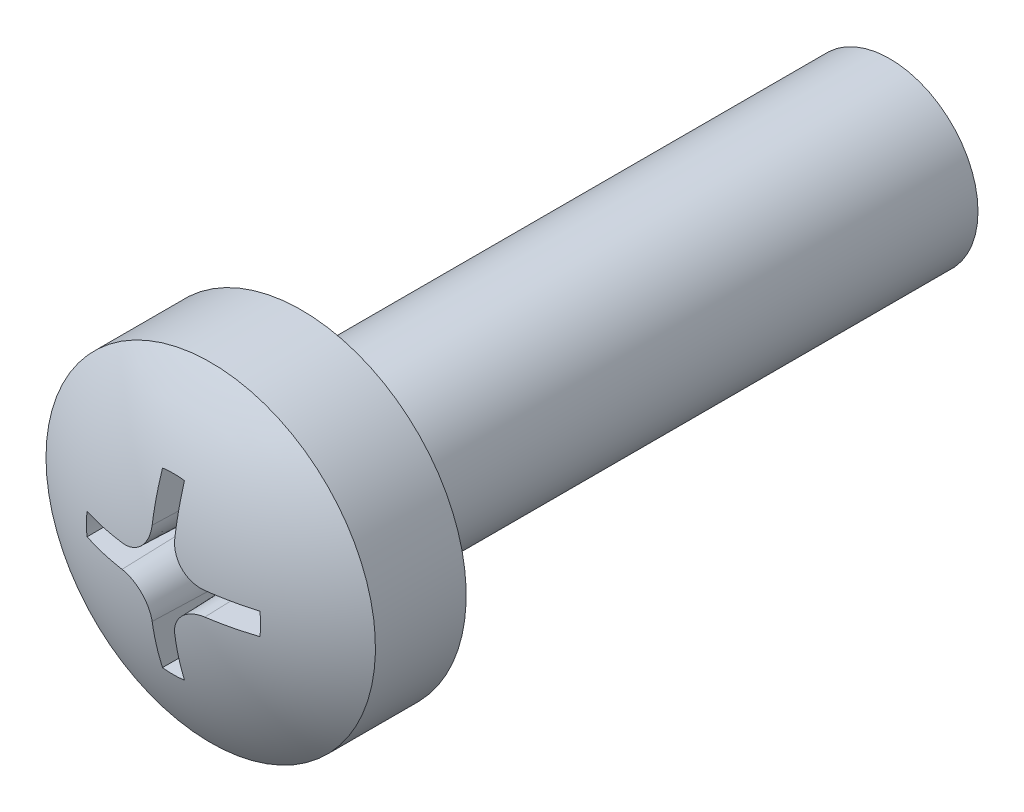
ISO-10303-21;
HEADER;
FILE_DESCRIPTION(('STEP AP214'),'2;1');
FILE_NAME('part.step','',(''),(''),'','','');
FILE_SCHEMA(('AUTOMOTIVE_DESIGN { 1 0 10303 214 1 1 1 1 }'));
ENDSEC;
DATA;
#1=APPLICATION_CONTEXT('core data for automotive mechanical design processes');
#2=APPLICATION_PROTOCOL_DEFINITION('international standard','automotive_design',2000,#1);
#3=PRODUCT_CONTEXT('',#1,'mechanical');
#4=PRODUCT('Part','Part','',(#3));
#5=PRODUCT_RELATED_PRODUCT_CATEGORY('part','',(#4));
#6=PRODUCT_DEFINITION_FORMATION('','',#4);
#7=PRODUCT_DEFINITION_CONTEXT('part definition',#1,'design');
#8=PRODUCT_DEFINITION('design','',#6,#7);
#9=PRODUCT_DEFINITION_SHAPE('','',#8);
#10=(LENGTH_UNIT() NAMED_UNIT(*) SI_UNIT(.MILLI.,.METRE.));
#11=(NAMED_UNIT(*) PLANE_ANGLE_UNIT() SI_UNIT($,.RADIAN.));
#12=(NAMED_UNIT(*) SI_UNIT($,.STERADIAN.) SOLID_ANGLE_UNIT());
#13=UNCERTAINTY_MEASURE_WITH_UNIT(LENGTH_MEASURE(1.E-05),#10,'distance_accuracy_value','');
#14=(GEOMETRIC_REPRESENTATION_CONTEXT(3) GLOBAL_UNCERTAINTY_ASSIGNED_CONTEXT((#13)) GLOBAL_UNIT_ASSIGNED_CONTEXT((#10,
#11,#12)) REPRESENTATION_CONTEXT('',''));
#15=CARTESIAN_POINT('',(0.,0.,0.));
#16=DIRECTION('',(0.,0.,1.));
#17=DIRECTION('',(1.,0.,0.));
#18=AXIS2_PLACEMENT_3D('',#15,#16,#17);
#19=CARTESIAN_POINT('',(0.,0.,10.));
#20=DIRECTION('',(0.,0.,-1.));
#21=DIRECTION('',(-1.,0.,0.));
#22=AXIS2_PLACEMENT_3D('',#19,#20,#21);
#23=CYLINDRICAL_SURFACE('',#22,1.5);
#24=CARTESIAN_POINT('',(0.,0.,10.));
#25=DIRECTION('',(0.,0.,1.));
#26=DIRECTION('',(1.,0.,0.));
#27=AXIS2_PLACEMENT_3D('',#24,#25,#26);
#28=CIRCLE('',#27,1.5);
#29=CARTESIAN_POINT('',(1.5,0.,10.));
#30=VERTEX_POINT('',#29);
#31=EDGE_CURVE('E208',#30,#30,#28,.T.);
#32=ORIENTED_EDGE('',*,*,#31,.F.);
#33=EDGE_LOOP('',(#32));
#34=FACE_BOUND('',#33,.T.);
#35=CARTESIAN_POINT('',(0.,0.,0.));
#36=DIRECTION('',(0.,0.,1.));
#37=DIRECTION('',(1.,0.,0.));
#38=AXIS2_PLACEMENT_3D('',#35,#36,#37);
#39=CIRCLE('',#38,1.5);
#40=CARTESIAN_POINT('',(1.5,0.,0.));
#41=VERTEX_POINT('',#40);
#42=EDGE_CURVE('E205',#41,#41,#39,.T.);
#43=ORIENTED_EDGE('',*,*,#42,.T.);
#44=EDGE_LOOP('',(#43));
#45=FACE_BOUND('',#44,.T.);
#46=ADVANCED_FACE('F34',(#34,#45),#23,.T.);
#47=CARTESIAN_POINT('',(0.,0.,0.));
#48=DIRECTION('',(0.,0.,1.));
#49=DIRECTION('',(1.,0.,0.));
#50=AXIS2_PLACEMENT_3D('',#47,#48,#49);
#51=PLANE('',#50);
#52=ORIENTED_EDGE('',*,*,#42,.F.);
#53=EDGE_LOOP('',(#52));
#54=FACE_BOUND('',#53,.T.);
#55=ADVANCED_FACE('F295',(#54),#51,.F.);
#56=CARTESIAN_POINT('',(0.,0.,10.));
#57=DIRECTION('',(0.,0.,-1.));
#58=DIRECTION('',(-1.,0.,0.));
#59=AXIS2_PLACEMENT_3D('',#56,#57,#58);
#60=PLANE('',#59);
#61=CARTESIAN_POINT('',(0.,0.,10.));
#62=DIRECTION('',(0.,0.,-1.));
#63=DIRECTION('',(-1.,0.,0.));
#64=AXIS2_PLACEMENT_3D('',#61,#62,#63);
#65=CIRCLE('',#64,2.79999990016222);
#66=CARTESIAN_POINT('',(-2.79999990016222,0.,10.));
#67=VERTEX_POINT('',#66);
#68=EDGE_CURVE('E202',#67,#67,#65,.T.);
#69=ORIENTED_EDGE('',*,*,#68,.T.);
#70=EDGE_LOOP('',(#69));
#71=FACE_BOUND('',#70,.T.);
#72=ORIENTED_EDGE('',*,*,#31,.T.);
#73=EDGE_LOOP('',(#72));
#74=FACE_BOUND('',#73,.T.);
#75=ADVANCED_FACE('F300',(#71,#74),#60,.T.);
#76=CARTESIAN_POINT('',(0.,0.,-0.393620134621003));
#77=DIRECTION('',(0.,0.,-1.));
#78=DIRECTION('',(-1.,0.,0.));
#79=AXIS2_PLACEMENT_3D('',#76,#77,#78);
#80=CYLINDRICAL_SURFACE('',#79,2.79999990016222);
#81=CARTESIAN_POINT('',(0.,0.,11.5424630797893));
#82=DIRECTION('',(0.,0.,-1.));
#83=DIRECTION('',(-1.,0.,0.));
#84=AXIS2_PLACEMENT_3D('',#81,#82,#83);
#85=CIRCLE('',#84,2.79999990016222);
#86=CARTESIAN_POINT('',(-2.79999990016222,0.,11.5424630797893));
#87=VERTEX_POINT('',#86);
#88=EDGE_CURVE('E150',#87,#87,#85,.T.);
#89=ORIENTED_EDGE('',*,*,#88,.T.);
#90=EDGE_LOOP('',(#89));
#91=FACE_BOUND('',#90,.T.);
#92=ORIENTED_EDGE('',*,*,#68,.F.);
#93=EDGE_LOOP('',(#92));
#94=FACE_BOUND('',#93,.T.);
#95=ADVANCED_FACE('F307',(#91,#94),#80,.T.);
#96=CARTESIAN_POINT('',(0.,0.,7.40000011175871));
#97=DIRECTION('',(0.,0.,-1.));
#98=DIRECTION('',(1.,0.,0.));
#99=AXIS2_PLACEMENT_3D('',#96,#97,#98);
#100=SPHERICAL_SURFACE('',#99,4.99999988824129);
#101=CARTESIAN_POINT('',(0.,0.,12.1754183821502));
#102=DIRECTION('',(0.,0.,-1.));
#103=DIRECTION('',(-1.,0.,0.));
#104=AXIS2_PLACEMENT_3D('',#101,#102,#103);
#105=CIRCLE('',#104,1.4816812157899);
#106=CARTESIAN_POINT('',(0.18668120666759,1.46987392394782,12.1754183821501));
#107=VERTEX_POINT('',#106);
#108=CARTESIAN_POINT('',(-0.186681206667593,1.46987392394782,12.1754183821501));
#109=VERTEX_POINT('',#108);
#110=EDGE_CURVE('E11',#107,#109,#105,.F.);
#111=ORIENTED_EDGE('',*,*,#110,.F.);
#112=CARTESIAN_POINT('',(0.0198956640512633,0.,7.39930533986049));
#113=DIRECTION('',(0.999390827019096,0.,-0.034899496702501));
#114=DIRECTION('',(-0.034899496702501,0.,-0.999390827019096));
#115=AXIS2_PLACEMENT_3D('',#112,#113,#114);
#116=CIRCLE('',#115,4.99996025606773);
#117=CARTESIAN_POINT('',(0.192632610704328,0.708178557647151,12.3458442955351));
#118=VERTEX_POINT('',#117);
#119=EDGE_CURVE('E41',#107,#118,#116,.T.);
#120=ORIENTED_EDGE('',*,*,#119,.T.);
#121=CARTESIAN_POINT('',(0.192631650862954,0.708378557647151,12.345815691475));
#122=CARTESIAN_POINT('',(0.192737639690806,0.679822741796073,12.3499041439734));
#123=CARTESIAN_POINT('',(0.195268867839181,0.651227392830895,12.3536463362414));
#124=CARTESIAN_POINT('',(0.205046889209158,0.594767038274589,12.3603460551712));
#125=CARTESIAN_POINT('',(0.212292618678018,0.566901869404939,12.3633037586285));
#126=CARTESIAN_POINT('',(0.231373694375068,0.51267267841366,12.3683466063254));
#127=CARTESIAN_POINT('',(0.24321326807329,0.486310064716558,12.3704309431667));
#128=CARTESIAN_POINT('',(0.271156607880554,0.435900324544808,12.3736603491012));
#129=CARTESIAN_POINT('',(0.287258672100205,0.411852279143785,12.3748057923215));
#130=CARTESIAN_POINT('',(0.323072075489885,0.367028886470806,12.3761158025717));
#131=CARTESIAN_POINT('',(0.342740648168188,0.346219679514825,12.3762912893596));
#132=CARTESIAN_POINT('',(0.385246757538768,0.30814670944778,12.3756853456951));
#133=CARTESIAN_POINT('',(0.408084792807392,0.290883505206881,12.3749037645383));
#134=CARTESIAN_POINT('',(0.456147210008961,0.260464262414973,12.3724133951705));
#135=CARTESIAN_POINT('',(0.481359759209805,0.247289131136678,12.3707090224733));
#136=CARTESIAN_POINT('',(0.533541444049374,0.225283958921734,12.3664258870809));
#137=CARTESIAN_POINT('',(0.560509920861878,0.216452298826715,12.3638474508254));
#138=CARTESIAN_POINT('',(0.606876295057338,0.205379627868596,12.3588207651558));
#139=CARTESIAN_POINT('',(0.626020977094074,0.201943221890058,12.3565812960749));
#140=CARTESIAN_POINT('',(0.664502044043211,0.197253494550335,12.3517582366185));
#141=CARTESIAN_POINT('',(0.683838077649067,0.195996727127303,12.349175196413));
#142=CARTESIAN_POINT('',(0.703167546290468,0.195835015722444,12.3464334662955));
#143=B_SPLINE_CURVE_WITH_KNOTS('',3,(#121,#122,#123,#124,#125,#126,#127,#128,#129,#130,#131,
#132,#133,#134,#135,#136,#137,#138,#139,#140,#141,#142),.UNSPECIFIED.,.F.,.F.,(4,2,2,2,2,2,2,2,
2,2,4),(0.,0.0864417829586748,0.172864068455127,0.259366073122685,0.345833591994609,
0.431325646912079,0.516831165542017,0.601931114274005,0.686999315371811,0.745618262708562,
0.804144447281415),.UNSPECIFIED.);
#144=CARTESIAN_POINT('',(0.702917362553185,0.19583721033533,12.3464689381926));
#145=VERTEX_POINT('',#144);
#146=EDGE_CURVE('E277',#118,#145,#143,.T.);
#147=ORIENTED_EDGE('',*,*,#146,.T.);
#148=CARTESIAN_POINT('',(0.000105390153350939,0.0259265633149154,7.39909472873738));
#149=DIRECTION('',(0.00406243901494415,0.999382570249833,-0.034899496702501));
#150=DIRECTION('',(0.,0.0348997846864301,0.999390816962434));
#151=AXIS2_PLACEMENT_3D('',#148,#149,#150);
#152=CIRCLE('',#151,4.99993258603575);
#153=CARTESIAN_POINT('',(1.46986565043204,0.186746338396853,12.1754183821502));
#154=VERTEX_POINT('',#153);
#155=EDGE_CURVE('E275',#154,#145,#152,.F.);
#156=ORIENTED_EDGE('',*,*,#155,.F.);
#157=CARTESIAN_POINT('',(0.,0.,12.1754183821502));
#158=DIRECTION('',(0.,0.,-1.));
#159=DIRECTION('',(-1.,0.,0.));
#160=AXIS2_PLACEMENT_3D('',#157,#158,#159);
#161=CIRCLE('',#160,1.4816812157899);
#162=CARTESIAN_POINT('',(1.46986565043204,-0.186746338396852,12.1754183821501));
#163=VERTEX_POINT('',#162);
#164=EDGE_CURVE('E273',#163,#154,#161,.F.);
#165=ORIENTED_EDGE('',*,*,#164,.F.);
#166=CARTESIAN_POINT('',(0.00010539015335097,-0.0259265633149168,7.39909472873738));
#167=DIRECTION('',(0.00406243901494512,-0.999382570249833,-0.034899496702501));
#168=DIRECTION('',(0.,0.0348997846864301,-0.999390816962434));
#169=AXIS2_PLACEMENT_3D('',#166,#167,#168);
#170=CIRCLE('',#169,4.99993258603575);
#171=CARTESIAN_POINT('',(0.702917362553185,-0.195837210335331,12.3464689381926));
#172=VERTEX_POINT('',#171);
#173=EDGE_CURVE('E270',#163,#172,#170,.T.);
#174=ORIENTED_EDGE('',*,*,#173,.T.);
#175=CARTESIAN_POINT('',(0.192631650862954,-0.708378557647152,12.345815691475));
#176=CARTESIAN_POINT('',(0.192737639690806,-0.679822741796074,12.3499041439734));
#177=CARTESIAN_POINT('',(0.195268867839181,-0.651227392830896,12.3536463362414));
#178=CARTESIAN_POINT('',(0.205046889209158,-0.59476703827459,12.3603460551712));
#179=CARTESIAN_POINT('',(0.212292618678018,-0.56690186940494,12.3633037586285));
#180=CARTESIAN_POINT('',(0.231373694375068,-0.512672678413661,12.3683466063254));
#181=CARTESIAN_POINT('',(0.24321326807329,-0.486310064716559,12.3704309431667));
#182=CARTESIAN_POINT('',(0.271156607880554,-0.435900324544809,12.3736603491012));
#183=CARTESIAN_POINT('',(0.287258672100205,-0.411852279143786,12.3748057923215));
#184=CARTESIAN_POINT('',(0.323072075489885,-0.367028886470807,12.3761158025717));
#185=CARTESIAN_POINT('',(0.342740648168188,-0.346219679514826,12.3762912893596));
#186=CARTESIAN_POINT('',(0.385246757538768,-0.30814670944778,12.3756853456951));
#187=CARTESIAN_POINT('',(0.408084792807392,-0.290883505206882,12.3749037645383));
#188=CARTESIAN_POINT('',(0.456147210008961,-0.260464262414974,12.3724133951705));
#189=CARTESIAN_POINT('',(0.481359759209805,-0.247289131136679,12.3707090224733));
#190=CARTESIAN_POINT('',(0.533541444049374,-0.225283958921735,12.3664258870809));
#191=CARTESIAN_POINT('',(0.560509920861877,-0.216452298826716,12.3638474508254));
#192=CARTESIAN_POINT('',(0.606876295057338,-0.205379627868597,12.3588207651558));
#193=CARTESIAN_POINT('',(0.626020977094074,-0.201943221890059,12.3565812960749));
#194=CARTESIAN_POINT('',(0.66450204404321,-0.197253494550336,12.3517582366185));
#195=CARTESIAN_POINT('',(0.683838077649067,-0.195996727127304,12.349175196413));
#196=CARTESIAN_POINT('',(0.703167546290467,-0.195835015722445,12.3464334662955));
#197=B_SPLINE_CURVE_WITH_KNOTS('',3,(#175,#176,#177,#178,#179,#180,#181,#182,#183,#184,#185,
#186,#187,#188,#189,#190,#191,#192,#193,#194,#195,#196),.UNSPECIFIED.,.F.,.F.,(4,2,2,2,2,2,2,2,
2,2,4),(0.,0.0864417829586748,0.172864068455127,0.259366073122684,0.345833591994609,
0.431325646912079,0.516831165542017,0.601931114274005,0.686999315371811,0.745618262708562,
0.804144447281415),.UNSPECIFIED.);
#198=CARTESIAN_POINT('',(0.192632610704328,-0.708178557647152,12.3458442955351));
#199=VERTEX_POINT('',#198);
#200=EDGE_CURVE('E264',#199,#172,#197,.T.);
#201=ORIENTED_EDGE('',*,*,#200,.F.);
#202=CARTESIAN_POINT('',(0.0198956640512633,0.,7.39930533986049));
#203=DIRECTION('',(0.999390827019096,0.,-0.034899496702501));
#204=DIRECTION('',(-0.034899496702501,0.,-0.999390827019096));
#205=AXIS2_PLACEMENT_3D('',#202,#203,#204);
#206=CIRCLE('',#205,4.99996025606773);
#207=CARTESIAN_POINT('',(0.186681206667591,-1.46987392394782,12.1754183821502));
#208=VERTEX_POINT('',#207);
#209=EDGE_CURVE('E262',#208,#199,#206,.F.);
#210=ORIENTED_EDGE('',*,*,#209,.F.);
#211=CARTESIAN_POINT('',(0.,0.,12.1754183821502));
#212=DIRECTION('',(0.,0.,-1.));
#213=DIRECTION('',(-1.,0.,0.));
#214=AXIS2_PLACEMENT_3D('',#211,#212,#213);
#215=CIRCLE('',#214,1.4816812157899);
#216=CARTESIAN_POINT('',(-0.186681206667593,-1.46987392394782,12.1754183821501));
#217=VERTEX_POINT('',#216);
#218=EDGE_CURVE('E259',#208,#217,#215,.T.);
#219=ORIENTED_EDGE('',*,*,#218,.T.);
#220=CARTESIAN_POINT('',(-0.0198956640512654,0.,7.39930533986049));
#221=DIRECTION('',(-0.999390827019096,0.,-0.034899496702501));
#222=DIRECTION('',(-0.034899496702501,0.,0.999390827019096));
#223=AXIS2_PLACEMENT_3D('',#220,#221,#222);
#224=CIRCLE('',#223,4.99996025606773);
#225=CARTESIAN_POINT('',(-0.19263261070433,-0.708178557647151,12.3458442955351));
#226=VERTEX_POINT('',#225);
#227=EDGE_CURVE('E255',#217,#226,#224,.T.);
#228=ORIENTED_EDGE('',*,*,#227,.T.);
#229=CARTESIAN_POINT('',(-0.70316754629047,-0.195835015722445,12.3464334662955));
#230=CARTESIAN_POINT('',(-0.674619447950853,-0.196052963217916,12.3504857241648));
#231=CARTESIAN_POINT('',(-0.646041434637229,-0.198695168407334,12.3541890416191));
#232=CARTESIAN_POINT('',(-0.589634494727846,-0.208689654905481,12.3608068014756));
#233=CARTESIAN_POINT('',(-0.561805393198952,-0.216040826152062,12.3637214295682));
#234=CARTESIAN_POINT('',(-0.50766612082123,-0.235323893103952,12.3686750861046));
#235=CARTESIAN_POINT('',(-0.481357369172764,-0.247259991703852,12.370713307523));
#236=CARTESIAN_POINT('',(-0.431071022991569,-0.275383990623327,12.3738489099634));
#237=CARTESIAN_POINT('',(-0.407092510169895,-0.291570206692358,12.3749466629444));
#238=CARTESIAN_POINT('',(-0.362416703115867,-0.327538701485094,12.3761618083202));
#239=CARTESIAN_POINT('',(-0.34168588735275,-0.347278991317759,12.376289966384));
#240=CARTESIAN_POINT('',(-0.303780328011577,-0.389912448398922,12.375590364716));
#241=CARTESIAN_POINT('',(-0.286606147147997,-0.412806113607388,12.3747624538554));
#242=CARTESIAN_POINT('',(-0.25636685808405,-0.460969475916929,12.3721816258056));
#243=CARTESIAN_POINT('',(-0.243283863198687,-0.486228184526672,12.3704328274806));
#244=CARTESIAN_POINT('',(-0.22146899790456,-0.538485231439468,12.366063898297));
#245=CARTESIAN_POINT('',(-0.212735526227358,-0.565482925398505,12.3634440886927));
#246=CARTESIAN_POINT('',(-0.201823996880683,-0.61191361527353,12.3583478129874));
#247=CARTESIAN_POINT('',(-0.198453223120025,-0.631098599357625,12.3560784464194));
#248=CARTESIAN_POINT('',(-0.193901764340931,-0.669652448873598,12.3511968730386));
#249=CARTESIAN_POINT('',(-0.192717622166763,-0.689020975292663,12.3485852144187));
#250=CARTESIAN_POINT('',(-0.192631650862956,-0.708378557647151,12.345815691475));
#251=B_SPLINE_CURVE_WITH_KNOTS('',3,(#229,#230,#231,#232,#233,#234,#235,#236,#237,#238,#239,
#240,#241,#242,#243,#244,#245,#246,#247,#248,#249,#250),.UNSPECIFIED.,.F.,.F.,(4,2,2,2,2,2,2,2,
2,2,4),(0.,0.0864053436114194,0.172790326060609,0.259254685287909,0.34568483171133,
0.431153892876567,0.51663646625136,0.601739908197796,0.686811996276178,0.745524819849982,
0.804144736260156),.UNSPECIFIED.);
#252=CARTESIAN_POINT('',(-0.702917362553187,-0.195837210335331,12.3464689381926));
#253=VERTEX_POINT('',#252);
#254=EDGE_CURVE('E248',#253,#226,#251,.T.);
#255=ORIENTED_EDGE('',*,*,#254,.F.);
#256=CARTESIAN_POINT('',(-0.000105390153349066,-0.0259265633149167,7.39909472873738));
#257=DIRECTION('',(-0.0040624390149453,-0.999382570249833,-0.034899496702501));
#258=DIRECTION('',(0.,0.0348997846864301,-0.999390816962434));
#259=AXIS2_PLACEMENT_3D('',#256,#257,#258);
#260=CIRCLE('',#259,4.99993258603575);
#261=CARTESIAN_POINT('',(-1.46986565043204,-0.186746338396853,12.1754183821502));
#262=VERTEX_POINT('',#261);
#263=EDGE_CURVE('E256',#262,#253,#260,.F.);
#264=ORIENTED_EDGE('',*,*,#263,.F.);
#265=CARTESIAN_POINT('',(0.,0.,12.1754183821502));
#266=DIRECTION('',(0.,0.,-1.));
#267=DIRECTION('',(-1.,0.,0.));
#268=AXIS2_PLACEMENT_3D('',#265,#266,#267);
#269=CIRCLE('',#268,1.4816812157899);
#270=CARTESIAN_POINT('',(-1.46986565043204,0.186746338396852,12.1754183821501));
#271=VERTEX_POINT('',#270);
#272=EDGE_CURVE('E594',#262,#271,#269,.T.);
#273=ORIENTED_EDGE('',*,*,#272,.T.);
#274=CARTESIAN_POINT('',(-0.000105390153349066,0.0259265633149167,7.39909472873738));
#275=DIRECTION('',(-0.00406243901494529,0.999382570249833,-0.034899496702501));
#276=DIRECTION('',(0.,0.0348997846864301,0.999390816962434));
#277=AXIS2_PLACEMENT_3D('',#274,#275,#276);
#278=CIRCLE('',#277,4.99993258603575);
#279=CARTESIAN_POINT('',(-0.702917362553187,0.195837210335331,12.3464689381926));
#280=VERTEX_POINT('',#279);
#281=EDGE_CURVE('E221',#271,#280,#278,.T.);
#282=ORIENTED_EDGE('',*,*,#281,.T.);
#283=CARTESIAN_POINT('',(-0.192631650862955,0.708378557647151,12.345815691475));
#284=CARTESIAN_POINT('',(-0.192737639690808,0.679822741796074,12.3499041439734));
#285=CARTESIAN_POINT('',(-0.195268867839183,0.651227392830896,12.3536463362414));
#286=CARTESIAN_POINT('',(-0.20504688920916,0.59476703827459,12.3603460551712));
#287=CARTESIAN_POINT('',(-0.21229261867802,0.566901869404939,12.3633037586285));
#288=CARTESIAN_POINT('',(-0.231373694375069,0.51267267841366,12.3683466063254));
#289=CARTESIAN_POINT('',(-0.243213268073292,0.486310064716559,12.3704309431667));
#290=CARTESIAN_POINT('',(-0.271156607880555,0.435900324544809,12.3736603491012));
#291=CARTESIAN_POINT('',(-0.287258672100206,0.411852279143786,12.3748057923215));
#292=CARTESIAN_POINT('',(-0.323072075489887,0.367028886470806,12.3761158025717));
#293=CARTESIAN_POINT('',(-0.34274064816819,0.346219679514826,12.3762912893596));
#294=CARTESIAN_POINT('',(-0.38524675753877,0.30814670944778,12.3756853456951));
#295=CARTESIAN_POINT('',(-0.408084792807394,0.290883505206882,12.3749037645383));
#296=CARTESIAN_POINT('',(-0.456147210008963,0.260464262414974,12.3724133951705));
#297=CARTESIAN_POINT('',(-0.481359759209807,0.247289131136679,12.3707090224733));
#298=CARTESIAN_POINT('',(-0.533541444049376,0.225283958921735,12.3664258870809));
#299=CARTESIAN_POINT('',(-0.560509920861879,0.216452298826716,12.3638474508254));
#300=CARTESIAN_POINT('',(-0.60687629505734,0.205379627868597,12.3588207651558));
#301=CARTESIAN_POINT('',(-0.626020977094076,0.201943221890059,12.3565812960749));
#302=CARTESIAN_POINT('',(-0.664502044043212,0.197253494550336,12.3517582366185));
#303=CARTESIAN_POINT('',(-0.683838077649068,0.195996727127304,12.349175196413));
#304=CARTESIAN_POINT('',(-0.703167546290469,0.195835015722445,12.3464334662955));
#305=B_SPLINE_CURVE_WITH_KNOTS('',3,(#283,#284,#285,#286,#287,#288,#289,#290,#291,#292,#293,
#294,#295,#296,#297,#298,#299,#300,#301,#302,#303,#304),.UNSPECIFIED.,.F.,.F.,(4,2,2,2,2,2,2,2,
2,2,4),(0.,0.0864417829586745,0.172864068455127,0.259366073122684,0.345833591994609,
0.431325646912079,0.516831165542016,0.601931114274004,0.686999315371811,0.745618262708562,
0.804144447281414),.UNSPECIFIED.);
#306=CARTESIAN_POINT('',(-0.19263261070433,0.708178557647151,12.3458442955351));
#307=VERTEX_POINT('',#306);
#308=EDGE_CURVE('E213',#307,#280,#305,.T.);
#309=ORIENTED_EDGE('',*,*,#308,.F.);
#310=CARTESIAN_POINT('',(-0.0198956640512643,0.,7.39930533986049));
#311=DIRECTION('',(-0.999390827019096,0.,-0.034899496702501));
#312=DIRECTION('',(-0.034899496702501,0.,0.999390827019096));
#313=AXIS2_PLACEMENT_3D('',#310,#311,#312);
#314=CIRCLE('',#313,4.99996025606773);
#315=EDGE_CURVE('E211',#109,#307,#314,.F.);
#316=ORIENTED_EDGE('',*,*,#315,.F.);
#317=EDGE_LOOP('',(#111,#120,#147,#156,#165,#174,#201,#210,#219,#228,#255,#264,#273,#282,#309,#316));
#318=FACE_BOUND('',#317,.T.);
#319=ORIENTED_EDGE('',*,*,#88,.F.);
#320=EDGE_LOOP('',(#319));
#321=FACE_BOUND('',#320,.T.);
#322=ADVANCED_FACE('F223',(#318,#321),#100,.T.);
#323=CARTESIAN_POINT('',(0.,0.,12.7000001));
#324=DIRECTION('',(0.,0.,1.));
#325=DIRECTION('',(1.,0.,0.));
#326=AXIS2_PLACEMENT_3D('',#323,#324,#325);
#327=CONICAL_SURFACE('',#326,1.50000001303852,0.0349065850398867);
#328=ORIENTED_EDGE('',*,*,#110,.T.);
#329=CARTESIAN_POINT('',(-0.142142619910814,1.43009594495933,10.9000001309199));
#330=CARTESIAN_POINT('',(-0.152618658076336,1.43957885994155,11.1999946132293));
#331=CARTESIAN_POINT('',(-0.163094792502732,1.4489727928664,11.4999918520894));
#332=CARTESIAN_POINT('',(-0.184047253837866,1.46758269456637,12.0999918417828));
#333=CARTESIAN_POINT('',(-0.194523580746602,1.47679866334215,12.399994592616));
#334=CARTESIAN_POINT('',(-0.205000003916213,1.48592565006124,12.7000001));
#335=B_SPLINE_CURVE_WITH_KNOTS('',3,(#329,#330,#331,#332,#333,#334),.UNSPECIFIED.,.F.,.F.,(4,2,
4),(0.,0.900981158642231,1.80196231389533),.UNSPECIFIED.);
#336=CARTESIAN_POINT('',(-0.142142619910814,1.43009594495933,10.9000001309199));
#337=VERTEX_POINT('',#336);
#338=EDGE_CURVE('E48',#337,#109,#335,.T.);
#339=ORIENTED_EDGE('',*,*,#338,.F.);
#340=CARTESIAN_POINT('',(0.,0.,10.9000001309199));
#341=DIRECTION('',(0.,0.,1.));
#342=DIRECTION('',(1.,0.,0.));
#343=AXIS2_PLACEMENT_3D('',#340,#341,#342);
#344=CIRCLE('',#343,1.43714262903312);
#345=CARTESIAN_POINT('',(0.142142619910811,1.43009594495933,10.9000001309199));
#346=VERTEX_POINT('',#345);
#347=EDGE_CURVE('E158',#346,#337,#344,.T.);
#348=ORIENTED_EDGE('',*,*,#347,.F.);
#349=CARTESIAN_POINT('',(0.142142619910811,1.43009594495933,10.9000001309199));
#350=CARTESIAN_POINT('',(0.152618658076333,1.43957885994155,11.1999946132293));
#351=CARTESIAN_POINT('',(0.16309479250273,1.4489727928664,11.4999918520894));
#352=CARTESIAN_POINT('',(0.184047253837863,1.46758269456637,12.0999918417828));
#353=CARTESIAN_POINT('',(0.1945235807466,1.47679866334215,12.399994592616));
#354=CARTESIAN_POINT('',(0.205000003916211,1.48592565006124,12.7000001));
#355=B_SPLINE_CURVE_WITH_KNOTS('',3,(#349,#350,#351,#352,#353,#354),.UNSPECIFIED.,.F.,.F.,(4,2,
4),(0.,0.900981158642231,1.80196231389533),.UNSPECIFIED.);
#356=EDGE_CURVE('E142',#346,#107,#355,.T.);
#357=ORIENTED_EDGE('',*,*,#356,.T.);
#358=EDGE_LOOP('',(#328,#339,#348,#357));
#359=FACE_BOUND('',#358,.T.);
#360=ADVANCED_FACE('F162',(#359),#327,.F.);
#361=CARTESIAN_POINT('',(0.205000003916211,1.48592565006124,12.7000001));
#362=DIRECTION('',(0.999390827019096,0.,-0.034899496702501));
#363=DIRECTION('',(-0.034899496702501,0.,-0.999390827019096));
#364=AXIS2_PLACEMENT_3D('',#361,#362,#363);
#365=PLANE('',#364);
#366=ORIENTED_EDGE('',*,*,#356,.F.);
#367=DIRECTION('',(0.,1.,0.));
#368=VECTOR('',#367,1.);
#369=CARTESIAN_POINT('',(0.142142619910812,0.,10.9000001309199));
#370=LINE('',#369,#368);
#371=CARTESIAN_POINT('',(0.142142619910811,0.708178557647151,10.9000001309199));
#372=VERTEX_POINT('',#371);
#373=EDGE_CURVE('E145',#346,#372,#370,.F.);
#374=ORIENTED_EDGE('',*,*,#373,.T.);
#375=DIRECTION('',(0.034899496702501,0.,0.999390827019096));
#376=VECTOR('',#375,1.);
#377=CARTESIAN_POINT('',(0.20500000391621,0.708178557647151,12.7000001));
#378=LINE('',#377,#376);
#379=EDGE_CURVE('E151',#372,#118,#378,.T.);
#380=ORIENTED_EDGE('',*,*,#379,.T.);
#381=ORIENTED_EDGE('',*,*,#119,.F.);
#382=EDGE_LOOP('',(#366,#374,#380,#381));
#383=FACE_BOUND('',#382,.T.);
#384=ADVANCED_FACE('F144',(#383),#365,.F.);
#385=CARTESIAN_POINT('',(0.705000003916211,0.708178557647151,12.7000001));
#386=DIRECTION('',(0.,0.,-1.));
#387=DIRECTION('',(1.,0.,0.));
#388=AXIS2_PLACEMENT_3D('',#385,#386,#387);
#389=CONICAL_SURFACE('',#388,0.5,0.0349065850398867);
#390=ORIENTED_EDGE('',*,*,#379,.F.);
#391=CARTESIAN_POINT('',(0.705000003916211,0.708178557647151,10.9000001309199));
#392=DIRECTION('',(0.,0.,1.));
#393=DIRECTION('',(1.,0.,0.));
#394=AXIS2_PLACEMENT_3D('',#391,#392,#393);
#395=CIRCLE('',#394,0.562857384005399);
#396=CARTESIAN_POINT('',(0.702712036351556,0.145325823858085,10.9000001309199));
#397=VERTEX_POINT('',#396);
#398=EDGE_CURVE('E160',#372,#397,#395,.T.);
#399=ORIENTED_EDGE('',*,*,#398,.T.);
#400=DIRECTION('',(0.000141863496415148,0.0348992083697649,0.999390827019096));
#401=VECTOR('',#400,1.);
#402=CARTESIAN_POINT('',(0.702967546290468,0.208182688548215,12.7000001));
#403=LINE('',#402,#401);
#404=EDGE_CURVE('E420',#397,#145,#403,.T.);
#405=ORIENTED_EDGE('',*,*,#404,.T.);
#406=ORIENTED_EDGE('',*,*,#146,.F.);
#407=EDGE_LOOP('',(#390,#399,#405,#406));
#408=FACE_BOUND('',#407,.T.);
#409=ADVANCED_FACE('F283',(#408),#389,.T.);
#410=CARTESIAN_POINT('',(1.48592565006123,0.205000003916213,12.7000001));
#411=DIRECTION('',(0.00406243901494415,0.999382570249833,-0.034899496702501));
#412=DIRECTION('',(0.,0.0348997846864301,0.999390816962434));
#413=AXIS2_PLACEMENT_3D('',#410,#411,#412);
#414=PLANE('',#413);
#415=ORIENTED_EDGE('',*,*,#155,.T.);
#416=ORIENTED_EDGE('',*,*,#404,.F.);
#417=DIRECTION('',(-0.99999173819787,0.00406491525148502,0.));
#418=VECTOR('',#417,1.);
#419=CARTESIAN_POINT('',(0.000602343564913371,0.148179863836023,10.9000001309199));
#420=LINE('',#419,#418);
#421=CARTESIAN_POINT('',(1.43007341244828,0.142369137079488,10.9000001309199));
#422=VERTEX_POINT('',#421);
#423=EDGE_CURVE('E171',#422,#397,#420,.T.);
#424=ORIENTED_EDGE('',*,*,#423,.F.);
#425=CARTESIAN_POINT('',(1.43007341244828,0.142369137079488,10.9000001309199));
#426=CARTESIAN_POINT('',(1.43955869120937,0.152806706922151,11.1999946790441));
#427=CARTESIAN_POINT('',(1.44895568373278,0.163244730756208,11.4999919508073));
#428=CARTESIAN_POINT('',(1.46757309626977,0.184121686368453,12.0999919405007));
#429=CARTESIAN_POINT('',(1.47679351628402,0.194560618146638,12.3999946584309));
#430=CARTESIAN_POINT('',(1.48592565006123,0.205000003916213,12.7000001));
#431=B_SPLINE_CURVE_WITH_KNOTS('',3,(#425,#426,#427,#428,#429,#430),.UNSPECIFIED.,.F.,.F.,(4,2,
4),(0.,0.900977563471273,1.80195512360615),.UNSPECIFIED.);
#432=EDGE_CURVE('E414',#422,#154,#431,.T.);
#433=ORIENTED_EDGE('',*,*,#432,.T.);
#434=EDGE_LOOP('',(#415,#416,#424,#433));
#435=FACE_BOUND('',#434,.T.);
#436=ADVANCED_FACE('F235',(#435),#414,.F.);
#437=CARTESIAN_POINT('',(0.,0.,12.7000001));
#438=DIRECTION('',(0.,0.,1.));
#439=DIRECTION('',(1.,0.,0.));
#440=AXIS2_PLACEMENT_3D('',#437,#438,#439);
#441=CONICAL_SURFACE('',#440,1.50000001303852,0.0349065850398867);
#442=ORIENTED_EDGE('',*,*,#164,.T.);
#443=ORIENTED_EDGE('',*,*,#432,.F.);
#444=CARTESIAN_POINT('',(0.,0.,10.9000001309199));
#445=DIRECTION('',(0.,0.,1.));
#446=DIRECTION('',(1.,0.,0.));
#447=AXIS2_PLACEMENT_3D('',#444,#445,#446);
#448=CIRCLE('',#447,1.43714262903312);
#449=CARTESIAN_POINT('',(1.43007341244828,-0.142369137079488,10.9000001309199));
#450=VERTEX_POINT('',#449);
#451=EDGE_CURVE('E173',#450,#422,#448,.T.);
#452=ORIENTED_EDGE('',*,*,#451,.F.);
#453=CARTESIAN_POINT('',(1.43007341244828,-0.142369137079488,10.9000001309199));
#454=CARTESIAN_POINT('',(1.43955869120937,-0.152806706922151,11.1999946790441));
#455=CARTESIAN_POINT('',(1.44895568373278,-0.163244730756208,11.4999919508073));
#456=CARTESIAN_POINT('',(1.46757309626977,-0.184121686368453,12.0999919405007));
#457=CARTESIAN_POINT('',(1.47679351628402,-0.194560618146638,12.3999946584309));
#458=CARTESIAN_POINT('',(1.48592565006123,-0.205000003916213,12.7000001));
#459=B_SPLINE_CURVE_WITH_KNOTS('',3,(#453,#454,#455,#456,#457,#458),.UNSPECIFIED.,.F.,.F.,(4,2,
4),(0.,0.900977563471273,1.80195512360615),.UNSPECIFIED.);
#460=EDGE_CURVE('E408',#450,#163,#459,.T.);
#461=ORIENTED_EDGE('',*,*,#460,.T.);
#462=EDGE_LOOP('',(#442,#443,#452,#461));
#463=FACE_BOUND('',#462,.T.);
#464=ADVANCED_FACE('F291',(#463),#441,.F.);
#465=CARTESIAN_POINT('',(1.48592565006123,-0.205000003916213,12.7000001));
#466=DIRECTION('',(0.00406243901494512,-0.999382570249833,-0.034899496702501));
#467=DIRECTION('',(0.,0.0348997846864301,-0.999390816962434));
#468=AXIS2_PLACEMENT_3D('',#465,#466,#467);
#469=PLANE('',#468);
#470=ORIENTED_EDGE('',*,*,#460,.F.);
#471=DIRECTION('',(0.99999173819787,0.00406491525148599,0.));
#472=VECTOR('',#471,1.);
#473=CARTESIAN_POINT('',(0.00060234356491352,-0.148179863836024,10.9000001309199));
#474=LINE('',#473,#472);
#475=CARTESIAN_POINT('',(0.702712036351556,-0.145325823858086,10.9000001309199));
#476=VERTEX_POINT('',#475);
#477=EDGE_CURVE('E176',#450,#476,#474,.F.);
#478=ORIENTED_EDGE('',*,*,#477,.T.);
#479=DIRECTION('',(0.000141863496415188,-0.0348992083697649,0.999390827019096));
#480=VECTOR('',#479,1.);
#481=CARTESIAN_POINT('',(0.702967546290468,-0.208182688548216,12.7000001));
#482=LINE('',#481,#480);
#483=EDGE_CURVE('E430',#476,#172,#482,.T.);
#484=ORIENTED_EDGE('',*,*,#483,.T.);
#485=ORIENTED_EDGE('',*,*,#173,.F.);
#486=EDGE_LOOP('',(#470,#478,#484,#485));
#487=FACE_BOUND('',#486,.T.);
#488=ADVANCED_FACE('F403',(#487),#469,.F.);
#489=CARTESIAN_POINT('',(0.705000003916211,-0.708178557647152,12.7000001));
#490=DIRECTION('',(0.,0.,-1.));
#491=DIRECTION('',(-1.,0.,0.));
#492=AXIS2_PLACEMENT_3D('',#489,#490,#491);
#493=CONICAL_SURFACE('',#492,0.5,0.0349065850398867);
#494=ORIENTED_EDGE('',*,*,#200,.T.);
#495=ORIENTED_EDGE('',*,*,#483,.F.);
#496=CARTESIAN_POINT('',(0.705000003916211,-0.708178557647152,10.9000001309199));
#497=DIRECTION('',(0.,0.,1.));
#498=DIRECTION('',(1.,0.,0.));
#499=AXIS2_PLACEMENT_3D('',#496,#497,#498);
#500=CIRCLE('',#499,0.562857384005399);
#501=CARTESIAN_POINT('',(0.142142619910812,-0.708178557647152,10.9000001309199));
#502=VERTEX_POINT('',#501);
#503=EDGE_CURVE('E178',#502,#476,#500,.F.);
#504=ORIENTED_EDGE('',*,*,#503,.F.);
#505=DIRECTION('',(0.034899496702501,0.,0.999390827019096));
#506=VECTOR('',#505,1.);
#507=CARTESIAN_POINT('',(0.205000003916211,-0.708178557647152,12.7000001));
#508=LINE('',#507,#506);
#509=EDGE_CURVE('E394',#502,#199,#508,.T.);
#510=ORIENTED_EDGE('',*,*,#509,.T.);
#511=EDGE_LOOP('',(#494,#495,#504,#510));
#512=FACE_BOUND('',#511,.T.);
#513=ADVANCED_FACE('F245',(#512),#493,.T.);
#514=CARTESIAN_POINT('',(0.205000003916211,-1.48592565006124,12.7000001));
#515=DIRECTION('',(0.999390827019096,0.,-0.034899496702501));
#516=DIRECTION('',(-0.034899496702501,0.,-0.999390827019096));
#517=AXIS2_PLACEMENT_3D('',#514,#515,#516);
#518=PLANE('',#517);
#519=ORIENTED_EDGE('',*,*,#209,.T.);
#520=ORIENTED_EDGE('',*,*,#509,.F.);
#521=DIRECTION('',(0.,1.,0.));
#522=VECTOR('',#521,1.);
#523=CARTESIAN_POINT('',(0.142142619910812,0.,10.9000001309199));
#524=LINE('',#523,#522);
#525=CARTESIAN_POINT('',(0.142142619910811,-1.43009594495933,10.9000001309199));
#526=VERTEX_POINT('',#525);
#527=EDGE_CURVE('E181',#526,#502,#524,.T.);
#528=ORIENTED_EDGE('',*,*,#527,.F.);
#529=CARTESIAN_POINT('',(0.142142619910811,-1.43009594495933,10.9000001309199));
#530=CARTESIAN_POINT('',(0.152618658076333,-1.43957885994155,11.1999946132293));
#531=CARTESIAN_POINT('',(0.16309479250273,-1.4489727928664,11.4999918520894));
#532=CARTESIAN_POINT('',(0.184047253837863,-1.46758269456637,12.0999918417828));
#533=CARTESIAN_POINT('',(0.1945235807466,-1.47679866334215,12.399994592616));
#534=CARTESIAN_POINT('',(0.205000003916211,-1.48592565006124,12.7000001));
#535=B_SPLINE_CURVE_WITH_KNOTS('',3,(#529,#530,#531,#532,#533,#534),.UNSPECIFIED.,.F.,.F.,(4,2,
4),(0.,0.900981158642231,1.80196231389533),.UNSPECIFIED.);
#536=EDGE_CURVE('E386',#526,#208,#535,.T.);
#537=ORIENTED_EDGE('',*,*,#536,.T.);
#538=EDGE_LOOP('',(#519,#520,#528,#537));
#539=FACE_BOUND('',#538,.T.);
#540=ADVANCED_FACE('F396',(#539),#518,.F.);
#541=CARTESIAN_POINT('',(0.,0.,12.7000001));
#542=DIRECTION('',(0.,0.,1.));
#543=DIRECTION('',(-1.,0.,0.));
#544=AXIS2_PLACEMENT_3D('',#541,#542,#543);
#545=CONICAL_SURFACE('',#544,1.50000001303852,0.0349065850398867);
#546=ORIENTED_EDGE('',*,*,#536,.F.);
#547=CARTESIAN_POINT('',(0.,0.,10.9000001309199));
#548=DIRECTION('',(0.,0.,1.));
#549=DIRECTION('',(1.,0.,0.));
#550=AXIS2_PLACEMENT_3D('',#547,#548,#549);
#551=CIRCLE('',#550,1.43714262903312);
#552=CARTESIAN_POINT('',(-0.142142619910814,-1.43009594495933,10.9000001309199));
#553=VERTEX_POINT('',#552);
#554=EDGE_CURVE('E184',#526,#553,#551,.F.);
#555=ORIENTED_EDGE('',*,*,#554,.T.);
#556=CARTESIAN_POINT('',(-0.142142619910814,-1.43009594495933,10.9000001309199));
#557=CARTESIAN_POINT('',(-0.152618658076336,-1.43957885994155,11.1999946132293));
#558=CARTESIAN_POINT('',(-0.163094792502732,-1.4489727928664,11.4999918520894));
#559=CARTESIAN_POINT('',(-0.184047253837866,-1.46758269456637,12.0999918417828));
#560=CARTESIAN_POINT('',(-0.194523580746602,-1.47679866334215,12.399994592616));
#561=CARTESIAN_POINT('',(-0.205000003916213,-1.48592565006124,12.7000001));
#562=B_SPLINE_CURVE_WITH_KNOTS('',3,(#556,#557,#558,#559,#560,#561),.UNSPECIFIED.,.F.,.F.,(4,2,
4),(0.,0.900981158642231,1.80196231389533),.UNSPECIFIED.);
#563=EDGE_CURVE('E378',#553,#217,#562,.T.);
#564=ORIENTED_EDGE('',*,*,#563,.T.);
#565=ORIENTED_EDGE('',*,*,#218,.F.);
#566=EDGE_LOOP('',(#546,#555,#564,#565));
#567=FACE_BOUND('',#566,.T.);
#568=ADVANCED_FACE('F373',(#567),#545,.F.);
#569=CARTESIAN_POINT('',(-0.205000003916213,-1.48592565006124,12.7000001));
#570=DIRECTION('',(-0.999390827019096,0.,-0.034899496702501));
#571=DIRECTION('',(-0.034899496702501,0.,0.999390827019096));
#572=AXIS2_PLACEMENT_3D('',#569,#570,#571);
#573=PLANE('',#572);
#574=ORIENTED_EDGE('',*,*,#563,.F.);
#575=DIRECTION('',(0.,-1.,0.));
#576=VECTOR('',#575,1.);
#577=CARTESIAN_POINT('',(-0.142142619910814,0.,10.9000001309199));
#578=LINE('',#577,#576);
#579=CARTESIAN_POINT('',(-0.142142619910814,-0.708178557647151,10.9000001309199));
#580=VERTEX_POINT('',#579);
#581=EDGE_CURVE('E186',#553,#580,#578,.F.);
#582=ORIENTED_EDGE('',*,*,#581,.T.);
#583=DIRECTION('',(-0.034899496702501,0.,0.999390827019096));
#584=VECTOR('',#583,1.);
#585=CARTESIAN_POINT('',(-0.205000003916213,-0.708178557647151,12.7000001));
#586=LINE('',#585,#584);
#587=EDGE_CURVE('E387',#580,#226,#586,.T.);
#588=ORIENTED_EDGE('',*,*,#587,.T.);
#589=ORIENTED_EDGE('',*,*,#227,.F.);
#590=EDGE_LOOP('',(#574,#582,#588,#589));
#591=FACE_BOUND('',#590,.T.);
#592=ADVANCED_FACE('F243',(#591),#573,.F.);
#593=CARTESIAN_POINT('',(-0.705000003916213,-0.708178557647151,12.7000001));
#594=DIRECTION('',(0.,0.,-1.));
#595=DIRECTION('',(-1.,0.,0.));
#596=AXIS2_PLACEMENT_3D('',#593,#594,#595);
#597=CONICAL_SURFACE('',#596,0.5,0.0349065850398867);
#598=ORIENTED_EDGE('',*,*,#254,.T.);
#599=ORIENTED_EDGE('',*,*,#587,.F.);
#600=CARTESIAN_POINT('',(-0.705000003916213,-0.708178557647151,10.9000001309199));
#601=DIRECTION('',(0.,0.,1.));
#602=DIRECTION('',(1.,0.,0.));
#603=AXIS2_PLACEMENT_3D('',#600,#601,#602);
#604=CIRCLE('',#603,0.562857384005399);
#605=CARTESIAN_POINT('',(-0.702712036351558,-0.145325823858086,10.9000001309199));
#606=VERTEX_POINT('',#605);
#607=EDGE_CURVE('E188',#606,#580,#604,.F.);
#608=ORIENTED_EDGE('',*,*,#607,.F.);
#609=DIRECTION('',(-0.000141863496415188,-0.0348992083697649,0.999390827019096));
#610=VECTOR('',#609,1.);
#611=CARTESIAN_POINT('',(-0.70296754629047,-0.208182688548216,12.7000001));
#612=LINE('',#611,#610);
#613=EDGE_CURVE('E586',#606,#253,#612,.T.);
#614=ORIENTED_EDGE('',*,*,#613,.T.);
#615=EDGE_LOOP('',(#598,#599,#608,#614));
#616=FACE_BOUND('',#615,.T.);
#617=ADVANCED_FACE('F238',(#616),#597,.T.);
#618=CARTESIAN_POINT('',(-1.48592565006124,-0.205000003916213,12.7000001));
#619=DIRECTION('',(-0.0040624390149453,-0.999382570249833,-0.034899496702501));
#620=DIRECTION('',(0.,0.0348997846864301,-0.999390816962434));
#621=AXIS2_PLACEMENT_3D('',#618,#619,#620);
#622=PLANE('',#621);
#623=ORIENTED_EDGE('',*,*,#263,.T.);
#624=ORIENTED_EDGE('',*,*,#613,.F.);
#625=DIRECTION('',(0.99999173819787,-0.00406491525148617,0.));
#626=VECTOR('',#625,1.);
#627=CARTESIAN_POINT('',(-0.000602343564913546,-0.148179863836024,10.9000001309199));
#628=LINE('',#627,#626);
#629=CARTESIAN_POINT('',(-1.43007341244828,-0.142369137079487,10.9000001309199));
#630=VERTEX_POINT('',#629);
#631=EDGE_CURVE('E191',#630,#606,#628,.T.);
#632=ORIENTED_EDGE('',*,*,#631,.F.);
#633=CARTESIAN_POINT('',(-1.43007341244828,-0.142369137079487,10.9000001309199));
#634=CARTESIAN_POINT('',(-1.43955869120937,-0.152806706922151,11.1999946790441));
#635=CARTESIAN_POINT('',(-1.44895568373278,-0.163244730756207,11.4999919508073));
#636=CARTESIAN_POINT('',(-1.46757309626978,-0.184121686368453,12.0999919405007));
#637=CARTESIAN_POINT('',(-1.47679351628402,-0.194560618146638,12.3999946584309));
#638=CARTESIAN_POINT('',(-1.48592565006124,-0.205000003916213,12.7000001));
#639=B_SPLINE_CURVE_WITH_KNOTS('',3,(#633,#634,#635,#636,#637,#638),.UNSPECIFIED.,.F.,.F.,(4,2,
4),(0.,0.900977563471273,1.80195512360615),.UNSPECIFIED.);
#640=EDGE_CURVE('E353',#630,#262,#639,.T.);
#641=ORIENTED_EDGE('',*,*,#640,.T.);
#642=EDGE_LOOP('',(#623,#624,#632,#641));
#643=FACE_BOUND('',#642,.T.);
#644=ADVANCED_FACE('F242',(#643),#622,.F.);
#645=CARTESIAN_POINT('',(0.,0.,12.7000001));
#646=DIRECTION('',(0.,0.,1.));
#647=DIRECTION('',(-1.,0.,0.));
#648=AXIS2_PLACEMENT_3D('',#645,#646,#647);
#649=CONICAL_SURFACE('',#648,1.50000001303852,0.0349065850398867);
#650=ORIENTED_EDGE('',*,*,#640,.F.);
#651=CARTESIAN_POINT('',(0.,0.,10.9000001309199));
#652=DIRECTION('',(0.,0.,1.));
#653=DIRECTION('',(1.,0.,0.));
#654=AXIS2_PLACEMENT_3D('',#651,#652,#653);
#655=CIRCLE('',#654,1.43714262903312);
#656=CARTESIAN_POINT('',(-1.43007341244828,0.142369137079487,10.9000001309199));
#657=VERTEX_POINT('',#656);
#658=EDGE_CURVE('E194',#630,#657,#655,.F.);
#659=ORIENTED_EDGE('',*,*,#658,.T.);
#660=CARTESIAN_POINT('',(-1.43007341244828,0.142369137079487,10.9000001309199));
#661=CARTESIAN_POINT('',(-1.43955869120937,0.152806706922151,11.1999946790441));
#662=CARTESIAN_POINT('',(-1.44895568373278,0.163244730756207,11.4999919508073));
#663=CARTESIAN_POINT('',(-1.46757309626978,0.184121686368453,12.0999919405007));
#664=CARTESIAN_POINT('',(-1.47679351628402,0.194560618146638,12.3999946584309));
#665=CARTESIAN_POINT('',(-1.48592565006124,0.205000003916213,12.7000001));
#666=B_SPLINE_CURVE_WITH_KNOTS('',3,(#660,#661,#662,#663,#664,#665),.UNSPECIFIED.,.F.,.F.,(4,2,
4),(0.,0.900977563471273,1.80195512360615),.UNSPECIFIED.);
#667=EDGE_CURVE('E336',#657,#271,#666,.T.);
#668=ORIENTED_EDGE('',*,*,#667,.T.);
#669=ORIENTED_EDGE('',*,*,#272,.F.);
#670=EDGE_LOOP('',(#650,#659,#668,#669));
#671=FACE_BOUND('',#670,.T.);
#672=ADVANCED_FACE('F361',(#671),#649,.F.);
#673=CARTESIAN_POINT('',(-1.48592565006124,0.205000003916213,12.7000001));
#674=DIRECTION('',(-0.00406243901494529,0.999382570249833,-0.034899496702501));
#675=DIRECTION('',(0.,0.0348997846864301,0.999390816962434));
#676=AXIS2_PLACEMENT_3D('',#673,#674,#675);
#677=PLANE('',#676);
#678=ORIENTED_EDGE('',*,*,#667,.F.);
#679=DIRECTION('',(-0.99999173819787,-0.00406491525148616,0.));
#680=VECTOR('',#679,1.);
#681=CARTESIAN_POINT('',(-0.000602343564913545,0.148179863836024,10.9000001309199));
#682=LINE('',#681,#680);
#683=CARTESIAN_POINT('',(-0.702712036351557,0.145325823858086,10.9000001309199));
#684=VERTEX_POINT('',#683);
#685=EDGE_CURVE('E196',#657,#684,#682,.F.);
#686=ORIENTED_EDGE('',*,*,#685,.T.);
#687=DIRECTION('',(-0.000141863496415188,0.0348992083697649,0.999390827019096));
#688=VECTOR('',#687,1.);
#689=CARTESIAN_POINT('',(-0.702967546290469,0.208182688548216,12.7000001));
#690=LINE('',#689,#688);
#691=EDGE_CURVE('E334',#684,#280,#690,.T.);
#692=ORIENTED_EDGE('',*,*,#691,.T.);
#693=ORIENTED_EDGE('',*,*,#281,.F.);
#694=EDGE_LOOP('',(#678,#686,#692,#693));
#695=FACE_BOUND('',#694,.T.);
#696=ADVANCED_FACE('F233',(#695),#677,.F.);
#697=CARTESIAN_POINT('',(-0.705000003916212,0.708178557647151,12.7000001));
#698=DIRECTION('',(0.,0.,-1.));
#699=DIRECTION('',(-1.,0.,0.));
#700=AXIS2_PLACEMENT_3D('',#697,#698,#699);
#701=CONICAL_SURFACE('',#700,0.5,0.0349065850398867);
#702=ORIENTED_EDGE('',*,*,#308,.T.);
#703=ORIENTED_EDGE('',*,*,#691,.F.);
#704=CARTESIAN_POINT('',(-0.705000003916212,0.708178557647151,10.9000001309199));
#705=DIRECTION('',(0.,0.,1.));
#706=DIRECTION('',(1.,0.,0.));
#707=AXIS2_PLACEMENT_3D('',#704,#705,#706);
#708=CIRCLE('',#707,0.562857384005399);
#709=CARTESIAN_POINT('',(-0.142142619910813,0.708178557647151,10.9000001309199));
#710=VERTEX_POINT('',#709);
#711=EDGE_CURVE('E165',#710,#684,#708,.F.);
#712=ORIENTED_EDGE('',*,*,#711,.F.);
#713=DIRECTION('',(-0.034899496702501,0.,0.999390827019096));
#714=VECTOR('',#713,1.);
#715=CARTESIAN_POINT('',(-0.205000003916212,0.708178557647151,12.7000001));
#716=LINE('',#715,#714);
#717=EDGE_CURVE('E330',#710,#307,#716,.T.);
#718=ORIENTED_EDGE('',*,*,#717,.T.);
#719=EDGE_LOOP('',(#702,#703,#712,#718));
#720=FACE_BOUND('',#719,.T.);
#721=ADVANCED_FACE('F227',(#720),#701,.T.);
#722=CARTESIAN_POINT('',(-0.205000003916213,1.48592565006124,12.7000001));
#723=DIRECTION('',(-0.999390827019096,0.,-0.034899496702501));
#724=DIRECTION('',(-0.034899496702501,0.,0.999390827019096));
#725=AXIS2_PLACEMENT_3D('',#722,#723,#724);
#726=PLANE('',#725);
#727=ORIENTED_EDGE('',*,*,#315,.T.);
#728=ORIENTED_EDGE('',*,*,#717,.F.);
#729=DIRECTION('',(0.,-1.,0.));
#730=VECTOR('',#729,1.);
#731=CARTESIAN_POINT('',(-0.142142619910813,0.,10.9000001309199));
#732=LINE('',#731,#730);
#733=EDGE_CURVE('E163',#337,#710,#732,.T.);
#734=ORIENTED_EDGE('',*,*,#733,.F.);
#735=ORIENTED_EDGE('',*,*,#338,.T.);
#736=EDGE_LOOP('',(#727,#728,#734,#735));
#737=FACE_BOUND('',#736,.T.);
#738=ADVANCED_FACE('F232',(#737),#726,.F.);
#739=CARTESIAN_POINT('',(0.,0.,10.9000001309199));
#740=DIRECTION('',(0.,0.,1.));
#741=DIRECTION('',(1.,0.,0.));
#742=AXIS2_PLACEMENT_3D('',#739,#740,#741);
#743=PLANE('',#742);
#744=ORIENTED_EDGE('',*,*,#347,.T.);
#745=ORIENTED_EDGE('',*,*,#733,.T.);
#746=ORIENTED_EDGE('',*,*,#711,.T.);
#747=ORIENTED_EDGE('',*,*,#685,.F.);
#748=ORIENTED_EDGE('',*,*,#658,.F.);
#749=ORIENTED_EDGE('',*,*,#631,.T.);
#750=ORIENTED_EDGE('',*,*,#607,.T.);
#751=ORIENTED_EDGE('',*,*,#581,.F.);
#752=ORIENTED_EDGE('',*,*,#554,.F.);
#753=ORIENTED_EDGE('',*,*,#527,.T.);
#754=ORIENTED_EDGE('',*,*,#503,.T.);
#755=ORIENTED_EDGE('',*,*,#477,.F.);
#756=ORIENTED_EDGE('',*,*,#451,.T.);
#757=ORIENTED_EDGE('',*,*,#423,.T.);
#758=ORIENTED_EDGE('',*,*,#398,.F.);
#759=ORIENTED_EDGE('',*,*,#373,.F.);
#760=EDGE_LOOP('',(#744,#745,#746,#747,#748,#749,#750,#751,#752,#753,#754,#755,#756,#757,#758,#759));
#761=FACE_BOUND('',#760,.T.);
#762=ADVANCED_FACE('F156',(#761),#743,.T.);
#763=CLOSED_SHELL('',(#46,#55,#75,#95,#322,#360,#384,#409,#436,#464,#488,#513,#540,#568,#592,
#617,#644,#672,#696,#721,#738,#762));
#764=MANIFOLD_SOLID_BREP('B2',#763);
#765=ADVANCED_BREP_SHAPE_REPRESENTATION('',(#18,#764),#14);
#766=SHAPE_DEFINITION_REPRESENTATION(#9,#765);
ENDSEC;
END-ISO-10303-21;
